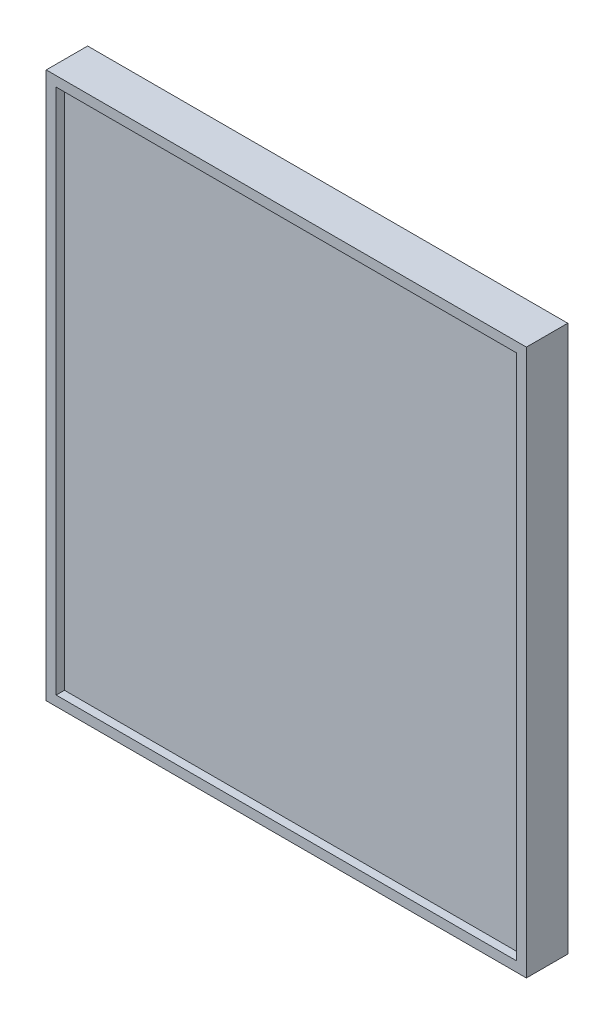
ISO-10303-21;
HEADER;
FILE_DESCRIPTION(('STEP AP214'),'2;1');
FILE_NAME('part.step','',(''),(''),'','','');
FILE_SCHEMA(('AUTOMOTIVE_DESIGN { 1 0 10303 214 1 1 1 1 }'));
ENDSEC;
DATA;
#1=APPLICATION_CONTEXT('core data for automotive mechanical design processes');
#2=APPLICATION_PROTOCOL_DEFINITION('international standard','automotive_design',2000,#1);
#3=PRODUCT_CONTEXT('',#1,'mechanical');
#4=PRODUCT('Part','Part','',(#3));
#5=PRODUCT_RELATED_PRODUCT_CATEGORY('part','',(#4));
#6=PRODUCT_DEFINITION_FORMATION('','',#4);
#7=PRODUCT_DEFINITION_CONTEXT('part definition',#1,'design');
#8=PRODUCT_DEFINITION('design','',#6,#7);
#9=PRODUCT_DEFINITION_SHAPE('','',#8);
#10=(LENGTH_UNIT() NAMED_UNIT(*) SI_UNIT(.MILLI.,.METRE.));
#11=(NAMED_UNIT(*) PLANE_ANGLE_UNIT() SI_UNIT($,.RADIAN.));
#12=(NAMED_UNIT(*) SI_UNIT($,.STERADIAN.) SOLID_ANGLE_UNIT());
#13=UNCERTAINTY_MEASURE_WITH_UNIT(LENGTH_MEASURE(1.E-05),#10,'distance_accuracy_value','');
#14=(GEOMETRIC_REPRESENTATION_CONTEXT(3) GLOBAL_UNCERTAINTY_ASSIGNED_CONTEXT((#13)) GLOBAL_UNIT_ASSIGNED_CONTEXT((#10,
#11,#12)) REPRESENTATION_CONTEXT('',''));
#15=CARTESIAN_POINT('',(0.,0.,0.));
#16=DIRECTION('',(0.,0.,1.));
#17=DIRECTION('',(1.,0.,0.));
#18=AXIS2_PLACEMENT_3D('',#15,#16,#17);
#19=CARTESIAN_POINT('',(0.,0.,25.));
#20=DIRECTION('',(0.,0.,1.));
#21=DIRECTION('',(1.,0.,0.));
#22=AXIS2_PLACEMENT_3D('',#19,#20,#21);
#23=PLANE('',#22);
#24=DIRECTION('',(1.,0.,0.));
#25=VECTOR('',#24,1.);
#26=CARTESIAN_POINT('',(-145.,165.,25.));
#27=LINE('',#26,#25);
#28=CARTESIAN_POINT('',(-145.,165.,25.));
#29=VERTEX_POINT('',#28);
#30=CARTESIAN_POINT('',(145.,165.,25.));
#31=VERTEX_POINT('',#30);
#32=EDGE_CURVE('E145',#29,#31,#27,.T.);
#33=ORIENTED_EDGE('',*,*,#32,.F.);
#34=DIRECTION('',(0.,1.,0.));
#35=VECTOR('',#34,1.);
#36=CARTESIAN_POINT('',(-145.,-165.,25.));
#37=LINE('',#36,#35);
#38=CARTESIAN_POINT('',(-145.,-165.,25.));
#39=VERTEX_POINT('',#38);
#40=EDGE_CURVE('E151',#39,#29,#37,.T.);
#41=ORIENTED_EDGE('',*,*,#40,.F.);
#42=DIRECTION('',(1.,0.,0.));
#43=VECTOR('',#42,1.);
#44=CARTESIAN_POINT('',(-145.,-165.,25.));
#45=LINE('',#44,#43);
#46=CARTESIAN_POINT('',(145.,-165.,25.));
#47=VERTEX_POINT('',#46);
#48=EDGE_CURVE('E149',#39,#47,#45,.T.);
#49=ORIENTED_EDGE('',*,*,#48,.T.);
#50=DIRECTION('',(0.,1.,0.));
#51=VECTOR('',#50,1.);
#52=CARTESIAN_POINT('',(145.,-165.,25.));
#53=LINE('',#52,#51);
#54=EDGE_CURVE('E83',#47,#31,#53,.T.);
#55=ORIENTED_EDGE('',*,*,#54,.T.);
#56=EDGE_LOOP('',(#33,#41,#49,#55));
#57=FACE_BOUND('',#56,.T.);
#58=DIRECTION('',(0.,1.,0.));
#59=VECTOR('',#58,1.);
#60=CARTESIAN_POINT('',(-139.,-159.,25.));
#61=LINE('',#60,#59);
#62=CARTESIAN_POINT('',(-139.,-159.,25.));
#63=VERTEX_POINT('',#62);
#64=CARTESIAN_POINT('',(-139.,159.,25.));
#65=VERTEX_POINT('',#64);
#66=EDGE_CURVE('E115',#63,#65,#61,.T.);
#67=ORIENTED_EDGE('',*,*,#66,.T.);
#68=DIRECTION('',(1.,0.,0.));
#69=VECTOR('',#68,1.);
#70=CARTESIAN_POINT('',(-139.,159.,25.));
#71=LINE('',#70,#69);
#72=CARTESIAN_POINT('',(139.,159.,25.));
#73=VERTEX_POINT('',#72);
#74=EDGE_CURVE('E50',#65,#73,#71,.T.);
#75=ORIENTED_EDGE('',*,*,#74,.T.);
#76=DIRECTION('',(0.,1.,0.));
#77=VECTOR('',#76,1.);
#78=CARTESIAN_POINT('',(139.,-159.,25.));
#79=LINE('',#78,#77);
#80=CARTESIAN_POINT('',(139.,-159.,25.));
#81=VERTEX_POINT('',#80);
#82=EDGE_CURVE('E122',#81,#73,#79,.T.);
#83=ORIENTED_EDGE('',*,*,#82,.F.);
#84=DIRECTION('',(1.,0.,0.));
#85=VECTOR('',#84,1.);
#86=CARTESIAN_POINT('',(-139.,-159.,25.));
#87=LINE('',#86,#85);
#88=EDGE_CURVE('E136',#63,#81,#87,.T.);
#89=ORIENTED_EDGE('',*,*,#88,.F.);
#90=EDGE_LOOP('',(#67,#75,#83,#89));
#91=FACE_BOUND('',#90,.T.);
#92=ADVANCED_FACE('F33',(#57,#91),#23,.T.);
#93=CARTESIAN_POINT('',(-145.,165.,25.));
#94=DIRECTION('',(0.,1.,0.));
#95=DIRECTION('',(0.,0.,1.));
#96=AXIS2_PLACEMENT_3D('',#93,#94,#95);
#97=PLANE('',#96);
#98=DIRECTION('',(1.,0.,0.));
#99=VECTOR('',#98,1.);
#100=CARTESIAN_POINT('',(-145.,165.,0.));
#101=LINE('',#100,#99);
#102=CARTESIAN_POINT('',(-145.,165.,0.));
#103=VERTEX_POINT('',#102);
#104=CARTESIAN_POINT('',(145.,165.,0.));
#105=VERTEX_POINT('',#104);
#106=EDGE_CURVE('E123',#103,#105,#101,.T.);
#107=ORIENTED_EDGE('',*,*,#106,.F.);
#108=DIRECTION('',(0.,0.,-1.));
#109=VECTOR('',#108,1.);
#110=CARTESIAN_POINT('',(-145.,165.,25.));
#111=LINE('',#110,#109);
#112=EDGE_CURVE('E11',#29,#103,#111,.T.);
#113=ORIENTED_EDGE('',*,*,#112,.F.);
#114=ORIENTED_EDGE('',*,*,#32,.T.);
#115=DIRECTION('',(0.,0.,-1.));
#116=VECTOR('',#115,1.);
#117=CARTESIAN_POINT('',(145.,165.,25.));
#118=LINE('',#117,#116);
#119=EDGE_CURVE('E37',#31,#105,#118,.T.);
#120=ORIENTED_EDGE('',*,*,#119,.T.);
#121=EDGE_LOOP('',(#107,#113,#114,#120));
#122=FACE_BOUND('',#121,.T.);
#123=ADVANCED_FACE('F35',(#122),#97,.T.);
#124=CARTESIAN_POINT('',(-145.,-165.,25.));
#125=DIRECTION('',(-1.,0.,0.));
#126=DIRECTION('',(0.,0.,1.));
#127=AXIS2_PLACEMENT_3D('',#124,#125,#126);
#128=PLANE('',#127);
#129=DIRECTION('',(0.,1.,0.));
#130=VECTOR('',#129,1.);
#131=CARTESIAN_POINT('',(-145.,-165.,0.));
#132=LINE('',#131,#130);
#133=CARTESIAN_POINT('',(-145.,-165.,0.));
#134=VERTEX_POINT('',#133);
#135=EDGE_CURVE('E147',#134,#103,#132,.T.);
#136=ORIENTED_EDGE('',*,*,#135,.F.);
#137=DIRECTION('',(0.,0.,-1.));
#138=VECTOR('',#137,1.);
#139=CARTESIAN_POINT('',(-145.,-165.,25.));
#140=LINE('',#139,#138);
#141=EDGE_CURVE('E42',#39,#134,#140,.T.);
#142=ORIENTED_EDGE('',*,*,#141,.F.);
#143=ORIENTED_EDGE('',*,*,#40,.T.);
#144=ORIENTED_EDGE('',*,*,#112,.T.);
#145=EDGE_LOOP('',(#136,#142,#143,#144));
#146=FACE_BOUND('',#145,.T.);
#147=ADVANCED_FACE('F171',(#146),#128,.T.);
#148=CARTESIAN_POINT('',(-145.,-165.,25.));
#149=DIRECTION('',(0.,1.,0.));
#150=DIRECTION('',(0.,0.,1.));
#151=AXIS2_PLACEMENT_3D('',#148,#149,#150);
#152=PLANE('',#151);
#153=DIRECTION('',(1.,0.,0.));
#154=VECTOR('',#153,1.);
#155=CARTESIAN_POINT('',(-145.,-165.,0.));
#156=LINE('',#155,#154);
#157=CARTESIAN_POINT('',(145.,-165.,0.));
#158=VERTEX_POINT('',#157);
#159=EDGE_CURVE('E158',#134,#158,#156,.T.);
#160=ORIENTED_EDGE('',*,*,#159,.T.);
#161=DIRECTION('',(0.,0.,-1.));
#162=VECTOR('',#161,1.);
#163=CARTESIAN_POINT('',(145.,-165.,25.));
#164=LINE('',#163,#162);
#165=EDGE_CURVE('E162',#47,#158,#164,.T.);
#166=ORIENTED_EDGE('',*,*,#165,.F.);
#167=ORIENTED_EDGE('',*,*,#48,.F.);
#168=ORIENTED_EDGE('',*,*,#141,.T.);
#169=EDGE_LOOP('',(#160,#166,#167,#168));
#170=FACE_BOUND('',#169,.T.);
#171=ADVANCED_FACE('F175',(#170),#152,.F.);
#172=CARTESIAN_POINT('',(145.,-165.,25.));
#173=DIRECTION('',(-1.,0.,0.));
#174=DIRECTION('',(0.,0.,1.));
#175=AXIS2_PLACEMENT_3D('',#172,#173,#174);
#176=PLANE('',#175);
#177=DIRECTION('',(0.,1.,0.));
#178=VECTOR('',#177,1.);
#179=CARTESIAN_POINT('',(145.,-165.,0.));
#180=LINE('',#179,#178);
#181=EDGE_CURVE('E155',#158,#105,#180,.T.);
#182=ORIENTED_EDGE('',*,*,#181,.T.);
#183=ORIENTED_EDGE('',*,*,#119,.F.);
#184=ORIENTED_EDGE('',*,*,#54,.F.);
#185=ORIENTED_EDGE('',*,*,#165,.T.);
#186=EDGE_LOOP('',(#182,#183,#184,#185));
#187=FACE_BOUND('',#186,.T.);
#188=ADVANCED_FACE('F167',(#187),#176,.F.);
#189=CARTESIAN_POINT('',(0.,0.,0.));
#190=DIRECTION('',(0.,0.,1.));
#191=DIRECTION('',(1.,0.,0.));
#192=AXIS2_PLACEMENT_3D('',#189,#190,#191);
#193=PLANE('',#192);
#194=ORIENTED_EDGE('',*,*,#106,.T.);
#195=ORIENTED_EDGE('',*,*,#181,.F.);
#196=ORIENTED_EDGE('',*,*,#159,.F.);
#197=ORIENTED_EDGE('',*,*,#135,.T.);
#198=EDGE_LOOP('',(#194,#195,#196,#197));
#199=FACE_BOUND('',#198,.T.);
#200=ADVANCED_FACE('F170',(#199),#193,.F.);
#201=CARTESIAN_POINT('',(-139.,159.,20.));
#202=DIRECTION('',(0.,-1.,0.));
#203=DIRECTION('',(0.,0.,-1.));
#204=AXIS2_PLACEMENT_3D('',#201,#202,#203);
#205=PLANE('',#204);
#206=ORIENTED_EDGE('',*,*,#74,.F.);
#207=DIRECTION('',(0.,0.,1.));
#208=VECTOR('',#207,1.);
#209=CARTESIAN_POINT('',(-139.,159.,20.));
#210=LINE('',#209,#208);
#211=CARTESIAN_POINT('',(-139.,159.,20.));
#212=VERTEX_POINT('',#211);
#213=EDGE_CURVE('E110',#212,#65,#210,.T.);
#214=ORIENTED_EDGE('',*,*,#213,.F.);
#215=DIRECTION('',(1.,0.,0.));
#216=VECTOR('',#215,1.);
#217=CARTESIAN_POINT('',(-139.,159.,20.));
#218=LINE('',#217,#216);
#219=CARTESIAN_POINT('',(139.,159.,20.));
#220=VERTEX_POINT('',#219);
#221=EDGE_CURVE('E105',#212,#220,#218,.T.);
#222=ORIENTED_EDGE('',*,*,#221,.T.);
#223=DIRECTION('',(0.,0.,1.));
#224=VECTOR('',#223,1.);
#225=CARTESIAN_POINT('',(139.,159.,20.));
#226=LINE('',#225,#224);
#227=EDGE_CURVE('E108',#220,#73,#226,.T.);
#228=ORIENTED_EDGE('',*,*,#227,.T.);
#229=EDGE_LOOP('',(#206,#214,#222,#228));
#230=FACE_BOUND('',#229,.T.);
#231=ADVANCED_FACE('F107',(#230),#205,.T.);
#232=CARTESIAN_POINT('',(139.,-159.,20.));
#233=DIRECTION('',(1.,0.,0.));
#234=DIRECTION('',(0.,0.,-1.));
#235=AXIS2_PLACEMENT_3D('',#232,#233,#234);
#236=PLANE('',#235);
#237=ORIENTED_EDGE('',*,*,#82,.T.);
#238=ORIENTED_EDGE('',*,*,#227,.F.);
#239=DIRECTION('',(0.,1.,0.));
#240=VECTOR('',#239,1.);
#241=CARTESIAN_POINT('',(139.,-159.,20.));
#242=LINE('',#241,#240);
#243=CARTESIAN_POINT('',(139.,-159.,20.));
#244=VERTEX_POINT('',#243);
#245=EDGE_CURVE('E114',#244,#220,#242,.T.);
#246=ORIENTED_EDGE('',*,*,#245,.F.);
#247=DIRECTION('',(0.,0.,1.));
#248=VECTOR('',#247,1.);
#249=CARTESIAN_POINT('',(139.,-159.,20.));
#250=LINE('',#249,#248);
#251=EDGE_CURVE('E124',#244,#81,#250,.T.);
#252=ORIENTED_EDGE('',*,*,#251,.T.);
#253=EDGE_LOOP('',(#237,#238,#246,#252));
#254=FACE_BOUND('',#253,.T.);
#255=ADVANCED_FACE('F119',(#254),#236,.F.);
#256=CARTESIAN_POINT('',(-139.,-159.,20.));
#257=DIRECTION('',(0.,-1.,0.));
#258=DIRECTION('',(0.,0.,-1.));
#259=AXIS2_PLACEMENT_3D('',#256,#257,#258);
#260=PLANE('',#259);
#261=ORIENTED_EDGE('',*,*,#88,.T.);
#262=ORIENTED_EDGE('',*,*,#251,.F.);
#263=DIRECTION('',(1.,0.,0.));
#264=VECTOR('',#263,1.);
#265=CARTESIAN_POINT('',(-139.,-159.,20.));
#266=LINE('',#265,#264);
#267=CARTESIAN_POINT('',(-139.,-159.,20.));
#268=VERTEX_POINT('',#267);
#269=EDGE_CURVE('E128',#268,#244,#266,.T.);
#270=ORIENTED_EDGE('',*,*,#269,.F.);
#271=DIRECTION('',(0.,0.,1.));
#272=VECTOR('',#271,1.);
#273=CARTESIAN_POINT('',(-139.,-159.,20.));
#274=LINE('',#273,#272);
#275=EDGE_CURVE('E142',#268,#63,#274,.T.);
#276=ORIENTED_EDGE('',*,*,#275,.T.);
#277=EDGE_LOOP('',(#261,#262,#270,#276));
#278=FACE_BOUND('',#277,.T.);
#279=ADVANCED_FACE('F184',(#278),#260,.F.);
#280=CARTESIAN_POINT('',(-139.,-159.,20.));
#281=DIRECTION('',(1.,0.,0.));
#282=DIRECTION('',(0.,0.,-1.));
#283=AXIS2_PLACEMENT_3D('',#280,#281,#282);
#284=PLANE('',#283);
#285=ORIENTED_EDGE('',*,*,#66,.F.);
#286=ORIENTED_EDGE('',*,*,#275,.F.);
#287=DIRECTION('',(0.,1.,0.));
#288=VECTOR('',#287,1.);
#289=CARTESIAN_POINT('',(-139.,-159.,20.));
#290=LINE('',#289,#288);
#291=EDGE_CURVE('E130',#268,#212,#290,.T.);
#292=ORIENTED_EDGE('',*,*,#291,.T.);
#293=ORIENTED_EDGE('',*,*,#213,.T.);
#294=EDGE_LOOP('',(#285,#286,#292,#293));
#295=FACE_BOUND('',#294,.T.);
#296=ADVANCED_FACE('F182',(#295),#284,.T.);
#297=CARTESIAN_POINT('',(0.,0.,20.));
#298=DIRECTION('',(0.,0.,1.));
#299=DIRECTION('',(1.,0.,0.));
#300=AXIS2_PLACEMENT_3D('',#297,#298,#299);
#301=PLANE('',#300);
#302=ORIENTED_EDGE('',*,*,#221,.F.);
#303=ORIENTED_EDGE('',*,*,#291,.F.);
#304=ORIENTED_EDGE('',*,*,#269,.T.);
#305=ORIENTED_EDGE('',*,*,#245,.T.);
#306=EDGE_LOOP('',(#302,#303,#304,#305));
#307=FACE_BOUND('',#306,.T.);
#308=ADVANCED_FACE('F126',(#307),#301,.T.);
#309=CLOSED_SHELL('',(#92,#123,#147,#171,#188,#200,#231,#255,#279,#296,#308));
#310=MANIFOLD_SOLID_BREP('B2',#309);
#311=ADVANCED_BREP_SHAPE_REPRESENTATION('',(#18,#310),#14);
#312=SHAPE_DEFINITION_REPRESENTATION(#9,#311);
ENDSEC;
END-ISO-10303-21;
